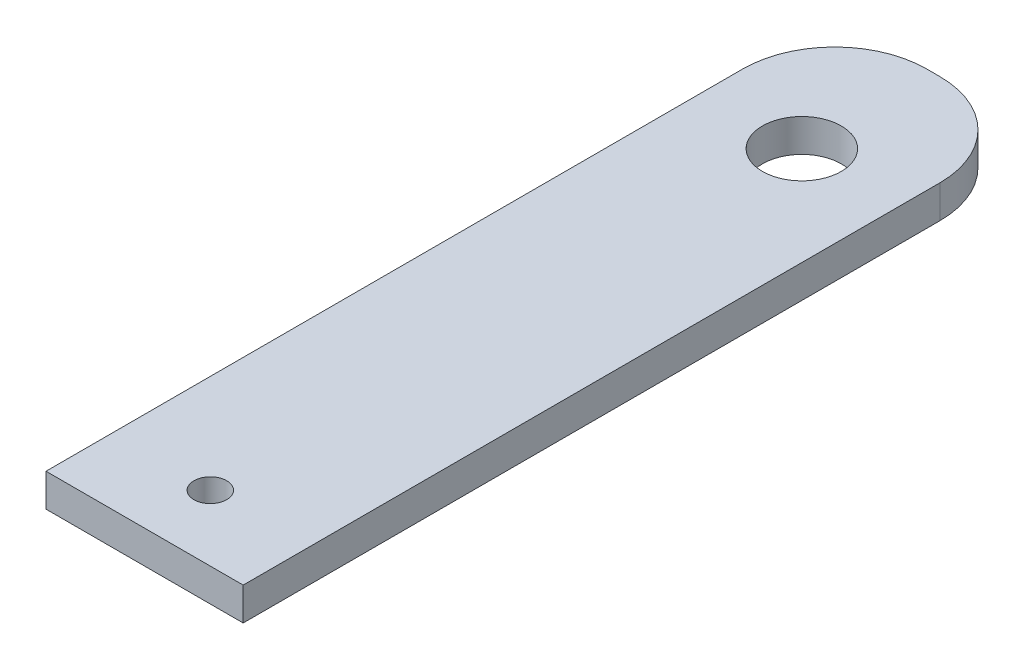
ISO-10303-21;
HEADER;
FILE_DESCRIPTION(('STEP AP214'),'2;1');
FILE_NAME('part.step','',(''),(''),'','','');
FILE_SCHEMA(('AUTOMOTIVE_DESIGN { 1 0 10303 214 1 1 1 1 }'));
ENDSEC;
DATA;
#1=APPLICATION_CONTEXT('core data for automotive mechanical design processes');
#2=APPLICATION_PROTOCOL_DEFINITION('international standard','automotive_design',2000,#1);
#3=PRODUCT_CONTEXT('',#1,'mechanical');
#4=PRODUCT('Part','Part','',(#3));
#5=PRODUCT_RELATED_PRODUCT_CATEGORY('part','',(#4));
#6=PRODUCT_DEFINITION_FORMATION('','',#4);
#7=PRODUCT_DEFINITION_CONTEXT('part definition',#1,'design');
#8=PRODUCT_DEFINITION('design','',#6,#7);
#9=PRODUCT_DEFINITION_SHAPE('','',#8);
#10=(LENGTH_UNIT() NAMED_UNIT(*) SI_UNIT(.MILLI.,.METRE.));
#11=(NAMED_UNIT(*) PLANE_ANGLE_UNIT() SI_UNIT($,.RADIAN.));
#12=(NAMED_UNIT(*) SI_UNIT($,.STERADIAN.) SOLID_ANGLE_UNIT());
#13=UNCERTAINTY_MEASURE_WITH_UNIT(LENGTH_MEASURE(1.E-05),#10,'distance_accuracy_value','');
#14=(GEOMETRIC_REPRESENTATION_CONTEXT(3) GLOBAL_UNCERTAINTY_ASSIGNED_CONTEXT((#13)) GLOBAL_UNIT_ASSIGNED_CONTEXT((#10,
#11,#12)) REPRESENTATION_CONTEXT('',''));
#15=CARTESIAN_POINT('',(0.,0.,0.));
#16=DIRECTION('',(0.,0.,1.));
#17=DIRECTION('',(1.,0.,0.));
#18=AXIS2_PLACEMENT_3D('',#15,#16,#17);
#19=CARTESIAN_POINT('',(-21.7232030129685,4.18199019467611,-18.7661769610431));
#20=DIRECTION('',(0.,1.,0.));
#21=DIRECTION('',(0.,0.,1.));
#22=AXIS2_PLACEMENT_3D('',#19,#20,#21);
#23=CYLINDRICAL_SURFACE('',#22,8.89);
#24=DIRECTION('',(0.,1.,0.));
#25=VECTOR('',#24,1.);
#26=CARTESIAN_POINT('',(-21.7232030129685,4.18199019467611,-27.656176961043));
#27=LINE('',#26,#25);
#28=CARTESIAN_POINT('',(-21.7232030129685,1.00699019467611,-27.656176961043));
#29=VERTEX_POINT('',#28);
#30=CARTESIAN_POINT('',(-21.7232030129685,4.18199019467611,-27.656176961043));
#31=VERTEX_POINT('',#30);
#32=EDGE_CURVE('E119',#29,#31,#27,.T.);
#33=ORIENTED_EDGE('',*,*,#32,.F.);
#34=CARTESIAN_POINT('',(-21.7232030129685,1.00699019467611,-18.7661769610431));
#35=DIRECTION('',(0.,1.,0.));
#36=DIRECTION('',(0.,0.,1.));
#37=AXIS2_PLACEMENT_3D('',#34,#35,#36);
#38=CIRCLE('',#37,8.89);
#39=CARTESIAN_POINT('',(-30.6132030129685,1.00699019467611,-18.7661769610431));
#40=VERTEX_POINT('',#39);
#41=EDGE_CURVE('E40',#40,#29,#38,.F.);
#42=ORIENTED_EDGE('',*,*,#41,.F.);
#43=DIRECTION('',(0.,1.,0.));
#44=VECTOR('',#43,1.);
#45=CARTESIAN_POINT('',(-30.6132030129685,4.18199019467611,-18.7661769610431));
#46=LINE('',#45,#44);
#47=CARTESIAN_POINT('',(-30.6132030129685,4.18199019467611,-18.7661769610431));
#48=VERTEX_POINT('',#47);
#49=EDGE_CURVE('E122',#48,#40,#46,.F.);
#50=ORIENTED_EDGE('',*,*,#49,.F.);
#51=CARTESIAN_POINT('',(-21.7232030129685,4.18199019467611,-18.7661769610431));
#52=DIRECTION('',(0.,1.,0.));
#53=DIRECTION('',(0.,0.,1.));
#54=AXIS2_PLACEMENT_3D('',#51,#52,#53);
#55=CIRCLE('',#54,8.89);
#56=EDGE_CURVE('E11',#31,#48,#55,.T.);
#57=ORIENTED_EDGE('',*,*,#56,.F.);
#58=EDGE_LOOP('',(#33,#42,#50,#57));
#59=FACE_BOUND('',#58,.T.);
#60=ADVANCED_FACE('F33',(#59),#23,.T.);
#61=CARTESIAN_POINT('',(-20.4532030129685,4.18199019467611,-18.7661769610431));
#62=DIRECTION('',(0.,1.,0.));
#63=DIRECTION('',(0.,0.,1.));
#64=AXIS2_PLACEMENT_3D('',#61,#62,#63);
#65=CYLINDRICAL_SURFACE('',#64,8.89);
#66=DIRECTION('',(0.,1.,0.));
#67=VECTOR('',#66,1.);
#68=CARTESIAN_POINT('',(-11.5632030129685,4.18199019467611,-18.7661769610431));
#69=LINE('',#68,#67);
#70=CARTESIAN_POINT('',(-11.5632030129685,1.00699019467611,-18.7661769610431));
#71=VERTEX_POINT('',#70);
#72=CARTESIAN_POINT('',(-11.5632030129685,4.18199019467611,-18.7661769610431));
#73=VERTEX_POINT('',#72);
#74=EDGE_CURVE('E104',#71,#73,#69,.T.);
#75=ORIENTED_EDGE('',*,*,#74,.F.);
#76=CARTESIAN_POINT('',(-20.4532030129685,1.00699019467611,-18.7661769610431));
#77=DIRECTION('',(0.,1.,0.));
#78=DIRECTION('',(0.,0.,1.));
#79=AXIS2_PLACEMENT_3D('',#76,#77,#78);
#80=CIRCLE('',#79,8.89);
#81=CARTESIAN_POINT('',(-20.4532030129685,1.00699019467611,-27.656176961043));
#82=VERTEX_POINT('',#81);
#83=EDGE_CURVE('E115',#82,#71,#80,.F.);
#84=ORIENTED_EDGE('',*,*,#83,.F.);
#85=DIRECTION('',(0.,1.,0.));
#86=VECTOR('',#85,1.);
#87=CARTESIAN_POINT('',(-20.4532030129685,4.18199019467611,-27.656176961043));
#88=LINE('',#87,#86);
#89=CARTESIAN_POINT('',(-20.4532030129685,4.18199019467611,-27.656176961043));
#90=VERTEX_POINT('',#89);
#91=EDGE_CURVE('E107',#90,#82,#88,.F.);
#92=ORIENTED_EDGE('',*,*,#91,.F.);
#93=CARTESIAN_POINT('',(-20.4532030129685,4.18199019467611,-18.7661769610431));
#94=DIRECTION('',(0.,1.,0.));
#95=DIRECTION('',(0.,0.,1.));
#96=AXIS2_PLACEMENT_3D('',#93,#94,#95);
#97=CIRCLE('',#96,8.89);
#98=EDGE_CURVE('E117',#73,#90,#97,.T.);
#99=ORIENTED_EDGE('',*,*,#98,.F.);
#100=EDGE_LOOP('',(#75,#84,#92,#99));
#101=FACE_BOUND('',#100,.T.);
#102=ADVANCED_FACE('F163',(#101),#65,.T.);
#103=CARTESIAN_POINT('',(-21.0882030129685,4.18199019467611,10.443823038957));
#104=DIRECTION('',(0.,1.,0.));
#105=DIRECTION('',(0.,0.,1.));
#106=AXIS2_PLACEMENT_3D('',#103,#104,#105);
#107=PLANE('',#106);
#108=CARTESIAN_POINT('',(-21.0882030129685,4.18199019467611,42.193823038957));
#109=DIRECTION('',(0.,1.,0.));
#110=DIRECTION('',(0.,0.,1.));
#111=AXIS2_PLACEMENT_3D('',#108,#109,#110);
#112=CIRCLE('',#111,1.5875);
#113=CARTESIAN_POINT('',(-21.0882030129685,4.18199019467611,43.781323038957));
#114=VERTEX_POINT('',#113);
#115=EDGE_CURVE('E148',#114,#114,#112,.T.);
#116=ORIENTED_EDGE('',*,*,#115,.F.);
#117=EDGE_LOOP('',(#116));
#118=FACE_BOUND('',#117,.T.);
#119=DIRECTION('',(-1.,0.,0.));
#120=VECTOR('',#119,1.);
#121=CARTESIAN_POINT('',(-30.6132030129685,4.18199019467611,-27.656176961043));
#122=LINE('',#121,#120);
#123=EDGE_CURVE('E109',#90,#31,#122,.T.);
#124=ORIENTED_EDGE('',*,*,#123,.T.);
#125=ORIENTED_EDGE('',*,*,#56,.T.);
#126=DIRECTION('',(0.,0.,1.));
#127=VECTOR('',#126,1.);
#128=CARTESIAN_POINT('',(-30.6132030129685,4.18199019467611,-27.656176961043));
#129=LINE('',#128,#127);
#130=CARTESIAN_POINT('',(-30.6132030129685,4.18199019467611,48.543823038957));
#131=VERTEX_POINT('',#130);
#132=EDGE_CURVE('E80',#48,#131,#129,.T.);
#133=ORIENTED_EDGE('',*,*,#132,.T.);
#134=DIRECTION('',(1.,0.,0.));
#135=VECTOR('',#134,1.);
#136=CARTESIAN_POINT('',(-30.6132030129685,4.18199019467611,48.543823038957));
#137=LINE('',#136,#135);
#138=CARTESIAN_POINT('',(-11.5632030129685,4.18199019467611,48.543823038957));
#139=VERTEX_POINT('',#138);
#140=EDGE_CURVE('E85',#131,#139,#137,.T.);
#141=ORIENTED_EDGE('',*,*,#140,.T.);
#142=DIRECTION('',(0.,0.,-1.));
#143=VECTOR('',#142,1.);
#144=CARTESIAN_POINT('',(-11.5632030129685,4.18199019467611,-27.656176961043));
#145=LINE('',#144,#143);
#146=EDGE_CURVE('E98',#139,#73,#145,.T.);
#147=ORIENTED_EDGE('',*,*,#146,.T.);
#148=ORIENTED_EDGE('',*,*,#98,.T.);
#149=EDGE_LOOP('',(#124,#125,#133,#141,#147,#148));
#150=FACE_BOUND('',#149,.T.);
#151=CARTESIAN_POINT('',(-21.0882030129685,4.18199019467611,-14.956176961043));
#152=DIRECTION('',(0.,1.,0.));
#153=DIRECTION('',(0.,0.,1.));
#154=AXIS2_PLACEMENT_3D('',#151,#152,#153);
#155=CIRCLE('',#154,3.81);
#156=CARTESIAN_POINT('',(-21.0882030129685,4.18199019467611,-11.146176961043));
#157=VERTEX_POINT('',#156);
#158=EDGE_CURVE('E139',#157,#157,#155,.T.);
#159=ORIENTED_EDGE('',*,*,#158,.F.);
#160=EDGE_LOOP('',(#159));
#161=FACE_BOUND('',#160,.T.);
#162=ADVANCED_FACE('F82',(#118,#150,#161),#107,.T.);
#163=CARTESIAN_POINT('',(-21.0882030129685,1.00699019467611,10.443823038957));
#164=DIRECTION('',(0.,1.,0.));
#165=DIRECTION('',(0.,0.,1.));
#166=AXIS2_PLACEMENT_3D('',#163,#164,#165);
#167=PLANE('',#166);
#168=CARTESIAN_POINT('',(-21.0882030129685,1.00699019467611,42.193823038957));
#169=DIRECTION('',(0.,1.,0.));
#170=DIRECTION('',(0.,0.,1.));
#171=AXIS2_PLACEMENT_3D('',#168,#169,#170);
#172=CIRCLE('',#171,1.5875);
#173=CARTESIAN_POINT('',(-21.0882030129685,1.00699019467611,43.781323038957));
#174=VERTEX_POINT('',#173);
#175=EDGE_CURVE('E145',#174,#174,#172,.T.);
#176=ORIENTED_EDGE('',*,*,#175,.T.);
#177=EDGE_LOOP('',(#176));
#178=FACE_BOUND('',#177,.T.);
#179=DIRECTION('',(0.,0.,1.));
#180=VECTOR('',#179,1.);
#181=CARTESIAN_POINT('',(-30.6132030129685,1.00699019467611,-27.656176961043));
#182=LINE('',#181,#180);
#183=CARTESIAN_POINT('',(-30.6132030129685,1.00699019467611,48.543823038957));
#184=VERTEX_POINT('',#183);
#185=EDGE_CURVE('E102',#40,#184,#182,.T.);
#186=ORIENTED_EDGE('',*,*,#185,.F.);
#187=ORIENTED_EDGE('',*,*,#41,.T.);
#188=DIRECTION('',(-1.,0.,0.));
#189=VECTOR('',#188,1.);
#190=CARTESIAN_POINT('',(-30.6132030129685,1.00699019467611,-27.656176961043));
#191=LINE('',#190,#189);
#192=EDGE_CURVE('E89',#82,#29,#191,.T.);
#193=ORIENTED_EDGE('',*,*,#192,.F.);
#194=ORIENTED_EDGE('',*,*,#83,.T.);
#195=DIRECTION('',(0.,0.,-1.));
#196=VECTOR('',#195,1.);
#197=CARTESIAN_POINT('',(-11.5632030129685,1.00699019467611,-27.656176961043));
#198=LINE('',#197,#196);
#199=CARTESIAN_POINT('',(-11.5632030129685,1.00699019467611,48.543823038957));
#200=VERTEX_POINT('',#199);
#201=EDGE_CURVE('E132',#200,#71,#198,.T.);
#202=ORIENTED_EDGE('',*,*,#201,.F.);
#203=DIRECTION('',(1.,0.,0.));
#204=VECTOR('',#203,1.);
#205=CARTESIAN_POINT('',(-30.6132030129685,1.00699019467611,48.543823038957));
#206=LINE('',#205,#204);
#207=EDGE_CURVE('E134',#184,#200,#206,.T.);
#208=ORIENTED_EDGE('',*,*,#207,.F.);
#209=EDGE_LOOP('',(#186,#187,#193,#194,#202,#208));
#210=FACE_BOUND('',#209,.T.);
#211=CARTESIAN_POINT('',(-21.0882030129685,1.00699019467611,-14.956176961043));
#212=DIRECTION('',(0.,1.,0.));
#213=DIRECTION('',(0.,0.,1.));
#214=AXIS2_PLACEMENT_3D('',#211,#212,#213);
#215=CIRCLE('',#214,3.81);
#216=CARTESIAN_POINT('',(-21.0882030129685,1.00699019467611,-11.146176961043));
#217=VERTEX_POINT('',#216);
#218=EDGE_CURVE('E142',#217,#217,#215,.T.);
#219=ORIENTED_EDGE('',*,*,#218,.T.);
#220=EDGE_LOOP('',(#219));
#221=FACE_BOUND('',#220,.T.);
#222=ADVANCED_FACE('F125',(#178,#210,#221),#167,.F.);
#223=CARTESIAN_POINT('',(-30.6132030129685,4.18199019467611,-27.656176961043));
#224=DIRECTION('',(1.,0.,0.));
#225=DIRECTION('',(0.,0.,-1.));
#226=AXIS2_PLACEMENT_3D('',#223,#224,#225);
#227=PLANE('',#226);
#228=ORIENTED_EDGE('',*,*,#132,.F.);
#229=ORIENTED_EDGE('',*,*,#49,.T.);
#230=ORIENTED_EDGE('',*,*,#185,.T.);
#231=DIRECTION('',(0.,-1.,0.));
#232=VECTOR('',#231,1.);
#233=CARTESIAN_POINT('',(-30.6132030129685,4.18199019467611,48.543823038957));
#234=LINE('',#233,#232);
#235=EDGE_CURVE('E94',#131,#184,#234,.T.);
#236=ORIENTED_EDGE('',*,*,#235,.F.);
#237=EDGE_LOOP('',(#228,#229,#230,#236));
#238=FACE_BOUND('',#237,.T.);
#239=ADVANCED_FACE('F100',(#238),#227,.F.);
#240=CARTESIAN_POINT('',(-30.6132030129685,4.18199019467611,48.543823038957));
#241=DIRECTION('',(0.,0.,-1.));
#242=DIRECTION('',(-1.,0.,0.));
#243=AXIS2_PLACEMENT_3D('',#240,#241,#242);
#244=PLANE('',#243);
#245=ORIENTED_EDGE('',*,*,#207,.T.);
#246=DIRECTION('',(0.,-1.,0.));
#247=VECTOR('',#246,1.);
#248=CARTESIAN_POINT('',(-11.5632030129685,4.18199019467611,48.543823038957));
#249=LINE('',#248,#247);
#250=EDGE_CURVE('E96',#139,#200,#249,.T.);
#251=ORIENTED_EDGE('',*,*,#250,.F.);
#252=ORIENTED_EDGE('',*,*,#140,.F.);
#253=ORIENTED_EDGE('',*,*,#235,.T.);
#254=EDGE_LOOP('',(#245,#251,#252,#253));
#255=FACE_BOUND('',#254,.T.);
#256=ADVANCED_FACE('F93',(#255),#244,.F.);
#257=CARTESIAN_POINT('',(-11.5632030129685,4.18199019467611,-27.656176961043));
#258=DIRECTION('',(-1.,0.,0.));
#259=DIRECTION('',(0.,0.,1.));
#260=AXIS2_PLACEMENT_3D('',#257,#258,#259);
#261=PLANE('',#260);
#262=ORIENTED_EDGE('',*,*,#201,.T.);
#263=ORIENTED_EDGE('',*,*,#74,.T.);
#264=ORIENTED_EDGE('',*,*,#146,.F.);
#265=ORIENTED_EDGE('',*,*,#250,.T.);
#266=EDGE_LOOP('',(#262,#263,#264,#265));
#267=FACE_BOUND('',#266,.T.);
#268=ADVANCED_FACE('F198',(#267),#261,.F.);
#269=CARTESIAN_POINT('',(-30.6132030129685,4.18199019467611,-27.656176961043));
#270=DIRECTION('',(0.,0.,1.));
#271=DIRECTION('',(1.,0.,0.));
#272=AXIS2_PLACEMENT_3D('',#269,#270,#271);
#273=PLANE('',#272);
#274=ORIENTED_EDGE('',*,*,#192,.T.);
#275=ORIENTED_EDGE('',*,*,#32,.T.);
#276=ORIENTED_EDGE('',*,*,#123,.F.);
#277=ORIENTED_EDGE('',*,*,#91,.T.);
#278=EDGE_LOOP('',(#274,#275,#276,#277));
#279=FACE_BOUND('',#278,.T.);
#280=ADVANCED_FACE('F130',(#279),#273,.F.);
#281=CARTESIAN_POINT('',(-21.0882030129685,4.18199019467611,-14.956176961043));
#282=DIRECTION('',(0.,-1.,0.));
#283=DIRECTION('',(0.,0.,-1.));
#284=AXIS2_PLACEMENT_3D('',#281,#282,#283);
#285=CYLINDRICAL_SURFACE('',#284,3.81);
#286=ORIENTED_EDGE('',*,*,#158,.T.);
#287=EDGE_LOOP('',(#286));
#288=FACE_BOUND('',#287,.T.);
#289=ORIENTED_EDGE('',*,*,#218,.F.);
#290=EDGE_LOOP('',(#289));
#291=FACE_BOUND('',#290,.T.);
#292=ADVANCED_FACE('F158',(#288,#291),#285,.F.);
#293=CARTESIAN_POINT('',(-21.0882030129685,1.00699019467611,42.193823038957));
#294=DIRECTION('',(0.,1.,0.));
#295=DIRECTION('',(0.,0.,1.));
#296=AXIS2_PLACEMENT_3D('',#293,#294,#295);
#297=CYLINDRICAL_SURFACE('',#296,1.5875);
#298=ORIENTED_EDGE('',*,*,#175,.F.);
#299=EDGE_LOOP('',(#298));
#300=FACE_BOUND('',#299,.T.);
#301=ORIENTED_EDGE('',*,*,#115,.T.);
#302=EDGE_LOOP('',(#301));
#303=FACE_BOUND('',#302,.T.);
#304=ADVANCED_FACE('F155',(#300,#303),#297,.F.);
#305=CLOSED_SHELL('',(#60,#102,#162,#222,#239,#256,#268,#280,#292,#304));
#306=MANIFOLD_SOLID_BREP('B2',#305);
#307=ADVANCED_BREP_SHAPE_REPRESENTATION('',(#18,#306),#14);
#308=SHAPE_DEFINITION_REPRESENTATION(#9,#307);
ENDSEC;
END-ISO-10303-21;
